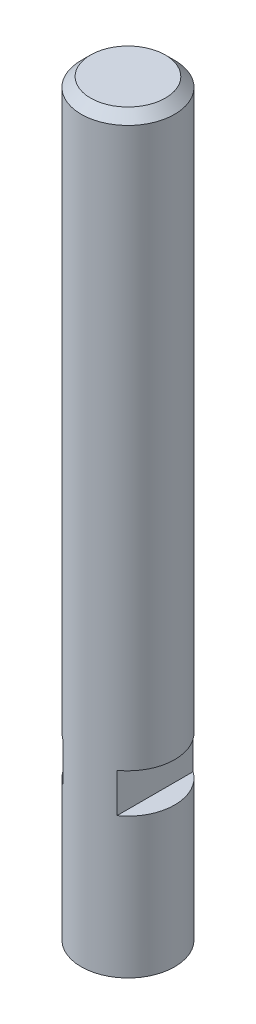
ISO-10303-21;
HEADER;
FILE_DESCRIPTION(('STEP AP214'),'2;1');
FILE_NAME('part.step','',(''),(''),'','','');
FILE_SCHEMA(('AUTOMOTIVE_DESIGN { 1 0 10303 214 1 1 1 1 }'));
ENDSEC;
DATA;
#1=APPLICATION_CONTEXT('core data for automotive mechanical design processes');
#2=APPLICATION_PROTOCOL_DEFINITION('international standard','automotive_design',2000,#1);
#3=PRODUCT_CONTEXT('',#1,'mechanical');
#4=PRODUCT('Part','Part','',(#3));
#5=PRODUCT_RELATED_PRODUCT_CATEGORY('part','',(#4));
#6=PRODUCT_DEFINITION_FORMATION('','',#4);
#7=PRODUCT_DEFINITION_CONTEXT('part definition',#1,'design');
#8=PRODUCT_DEFINITION('design','',#6,#7);
#9=PRODUCT_DEFINITION_SHAPE('','',#8);
#10=(LENGTH_UNIT() NAMED_UNIT(*) SI_UNIT(.MILLI.,.METRE.));
#11=(NAMED_UNIT(*) PLANE_ANGLE_UNIT() SI_UNIT($,.RADIAN.));
#12=(NAMED_UNIT(*) SI_UNIT($,.STERADIAN.) SOLID_ANGLE_UNIT());
#13=UNCERTAINTY_MEASURE_WITH_UNIT(LENGTH_MEASURE(1.E-05),#10,'distance_accuracy_value','');
#14=(GEOMETRIC_REPRESENTATION_CONTEXT(3) GLOBAL_UNCERTAINTY_ASSIGNED_CONTEXT((#13)) GLOBAL_UNIT_ASSIGNED_CONTEXT((#10,
#11,#12)) REPRESENTATION_CONTEXT('',''));
#15=CARTESIAN_POINT('',(0.,0.,0.));
#16=DIRECTION('',(0.,0.,1.));
#17=DIRECTION('',(1.,0.,0.));
#18=AXIS2_PLACEMENT_3D('',#15,#16,#17);
#19=CARTESIAN_POINT('',(0.,0.,0.));
#20=DIRECTION('',(0.,1.,0.));
#21=DIRECTION('',(0.,0.,1.));
#22=AXIS2_PLACEMENT_3D('',#19,#20,#21);
#23=CYLINDRICAL_SURFACE('',#22,5.);
#24=CARTESIAN_POINT('',(0.,79.,0.));
#25=DIRECTION('',(0.,1.,0.));
#26=DIRECTION('',(0.,0.,1.));
#27=AXIS2_PLACEMENT_3D('',#24,#25,#26);
#28=CIRCLE('',#27,5.);
#29=CARTESIAN_POINT('',(0.,79.,5.));
#30=VERTEX_POINT('',#29);
#31=EDGE_CURVE('E11',#30,#30,#28,.F.);
#32=ORIENTED_EDGE('',*,*,#31,.T.);
#33=EDGE_LOOP('',(#32));
#34=FACE_BOUND('',#33,.T.);
#35=CARTESIAN_POINT('',(0.,0.,0.));
#36=DIRECTION('',(0.,1.,0.));
#37=DIRECTION('',(0.,0.,1.));
#38=AXIS2_PLACEMENT_3D('',#35,#36,#37);
#39=CIRCLE('',#38,5.);
#40=CARTESIAN_POINT('',(0.,0.,5.));
#41=VERTEX_POINT('',#40);
#42=EDGE_CURVE('E160',#41,#41,#39,.T.);
#43=ORIENTED_EDGE('',*,*,#42,.T.);
#44=EDGE_LOOP('',(#43));
#45=FACE_BOUND('',#44,.T.);
#46=CARTESIAN_POINT('',(0.,15.,0.));
#47=DIRECTION('',(0.,-1.,0.));
#48=DIRECTION('',(0.,0.,-1.));
#49=AXIS2_PLACEMENT_3D('',#46,#47,#48);
#50=CIRCLE('',#49,5.);
#51=CARTESIAN_POINT('',(-2.9,15.,-4.07308237088327));
#52=VERTEX_POINT('',#51);
#53=CARTESIAN_POINT('',(-2.9,15.,4.07308237088327));
#54=VERTEX_POINT('',#53);
#55=EDGE_CURVE('E84',#52,#54,#50,.F.);
#56=ORIENTED_EDGE('',*,*,#55,.F.);
#57=DIRECTION('',(0.,1.,0.));
#58=VECTOR('',#57,1.);
#59=CARTESIAN_POINT('',(-2.9,0.,-4.07308237088327));
#60=LINE('',#59,#58);
#61=CARTESIAN_POINT('',(-2.9,19.2,-4.07308237088327));
#62=VERTEX_POINT('',#61);
#63=EDGE_CURVE('E167',#62,#52,#60,.F.);
#64=ORIENTED_EDGE('',*,*,#63,.F.);
#65=CARTESIAN_POINT('',(0.,19.2,0.));
#66=DIRECTION('',(0.,1.,0.));
#67=DIRECTION('',(0.,0.,1.));
#68=AXIS2_PLACEMENT_3D('',#65,#66,#67);
#69=CIRCLE('',#68,5.);
#70=CARTESIAN_POINT('',(-2.9,19.2,4.07308237088327));
#71=VERTEX_POINT('',#70);
#72=EDGE_CURVE('E163',#71,#62,#69,.F.);
#73=ORIENTED_EDGE('',*,*,#72,.F.);
#74=DIRECTION('',(0.,1.,0.));
#75=VECTOR('',#74,1.);
#76=CARTESIAN_POINT('',(-2.9,0.,4.07308237088327));
#77=LINE('',#76,#75);
#78=EDGE_CURVE('E165',#54,#71,#77,.T.);
#79=ORIENTED_EDGE('',*,*,#78,.F.);
#80=EDGE_LOOP('',(#56,#64,#73,#79));
#81=FACE_BOUND('',#80,.T.);
#82=DIRECTION('',(0.,1.,0.));
#83=VECTOR('',#82,1.);
#84=CARTESIAN_POINT('',(2.9,0.,4.07308237088327));
#85=LINE('',#84,#83);
#86=CARTESIAN_POINT('',(2.9,15.,4.07308237088327));
#87=VERTEX_POINT('',#86);
#88=CARTESIAN_POINT('',(2.9,19.2,4.07308237088327));
#89=VERTEX_POINT('',#88);
#90=EDGE_CURVE('E83',#87,#89,#85,.T.);
#91=ORIENTED_EDGE('',*,*,#90,.T.);
#92=CARTESIAN_POINT('',(0.,19.2,0.));
#93=DIRECTION('',(0.,-1.,0.));
#94=DIRECTION('',(0.,0.,-1.));
#95=AXIS2_PLACEMENT_3D('',#92,#93,#94);
#96=CIRCLE('',#95,5.);
#97=CARTESIAN_POINT('',(2.9,19.2,-4.07308237088327));
#98=VERTEX_POINT('',#97);
#99=EDGE_CURVE('E94',#89,#98,#96,.F.);
#100=ORIENTED_EDGE('',*,*,#99,.T.);
#101=DIRECTION('',(0.,1.,0.));
#102=VECTOR('',#101,1.);
#103=CARTESIAN_POINT('',(2.9,0.,-4.07308237088327));
#104=LINE('',#103,#102);
#105=CARTESIAN_POINT('',(2.9,15.,-4.07308237088327));
#106=VERTEX_POINT('',#105);
#107=EDGE_CURVE('E89',#98,#106,#104,.F.);
#108=ORIENTED_EDGE('',*,*,#107,.T.);
#109=CARTESIAN_POINT('',(0.,15.,0.));
#110=DIRECTION('',(0.,1.,0.));
#111=DIRECTION('',(0.,0.,1.));
#112=AXIS2_PLACEMENT_3D('',#109,#110,#111);
#113=CIRCLE('',#112,5.);
#114=EDGE_CURVE('E78',#106,#87,#113,.F.);
#115=ORIENTED_EDGE('',*,*,#114,.T.);
#116=EDGE_LOOP('',(#91,#100,#108,#115));
#117=FACE_BOUND('',#116,.T.);
#118=ADVANCED_FACE('F36',(#34,#45,#81,#117),#23,.T.);
#119=CARTESIAN_POINT('',(0.,80.,0.));
#120=DIRECTION('',(0.,1.,0.));
#121=DIRECTION('',(0.,0.,1.));
#122=AXIS2_PLACEMENT_3D('',#119,#120,#121);
#123=PLANE('',#122);
#124=CARTESIAN_POINT('',(0.,80.,0.));
#125=DIRECTION('',(0.,1.,0.));
#126=DIRECTION('',(0.,0.,1.));
#127=AXIS2_PLACEMENT_3D('',#124,#125,#126);
#128=CIRCLE('',#127,4.00000000000001);
#129=CARTESIAN_POINT('',(0.,80.,4.00000000000001));
#130=VERTEX_POINT('',#129);
#131=EDGE_CURVE('E44',#130,#130,#128,.T.);
#132=ORIENTED_EDGE('',*,*,#131,.T.);
#133=EDGE_LOOP('',(#132));
#134=FACE_BOUND('',#133,.T.);
#135=ADVANCED_FACE('F101',(#134),#123,.T.);
#136=CARTESIAN_POINT('',(0.,0.,5.));
#137=DIRECTION('',(0.,-1.,0.));
#138=DIRECTION('',(0.,0.,-1.));
#139=AXIS2_PLACEMENT_3D('',#136,#137,#138);
#140=PLANE('',#139);
#141=CARTESIAN_POINT('',(0.,0.,0.));
#142=DIRECTION('',(0.,-1.,0.));
#143=DIRECTION('',(0.,0.,-1.));
#144=AXIS2_PLACEMENT_3D('',#141,#142,#143);
#145=CIRCLE('',#144,1.64999999999999);
#146=CARTESIAN_POINT('',(0.,0.,-1.64999999999999));
#147=VERTEX_POINT('',#146);
#148=EDGE_CURVE('E153',#147,#147,#145,.T.);
#149=ORIENTED_EDGE('',*,*,#148,.F.);
#150=EDGE_LOOP('',(#149));
#151=FACE_BOUND('',#150,.T.);
#152=ORIENTED_EDGE('',*,*,#42,.F.);
#153=EDGE_LOOP('',(#152));
#154=FACE_BOUND('',#153,.T.);
#155=ADVANCED_FACE('F117',(#151,#154),#140,.T.);
#156=CARTESIAN_POINT('',(0.,40.,0.));
#157=DIRECTION('',(0.,-1.,0.));
#158=DIRECTION('',(0.,0.,-1.));
#159=AXIS2_PLACEMENT_3D('',#156,#157,#158);
#160=CONICAL_SURFACE('',#159,1.64999999999999,1.02974425867665);
#161=CARTESIAN_POINT('',(0.,40.9914200213955,0.));
#162=VERTEX_POINT('',#161);
#163=VERTEX_LOOP('',#162);
#164=FACE_BOUND('',#163,.T.);
#165=CARTESIAN_POINT('',(0.,40.,0.));
#166=DIRECTION('',(0.,-1.,0.));
#167=DIRECTION('',(0.,0.,-1.));
#168=AXIS2_PLACEMENT_3D('',#165,#166,#167);
#169=CIRCLE('',#168,1.64999999999999);
#170=CARTESIAN_POINT('',(0.,40.,-1.64999999999999));
#171=VERTEX_POINT('',#170);
#172=EDGE_CURVE('E157',#171,#171,#169,.T.);
#173=ORIENTED_EDGE('',*,*,#172,.T.);
#174=EDGE_LOOP('',(#173));
#175=FACE_BOUND('',#174,.T.);
#176=ADVANCED_FACE('F122',(#164,#175),#160,.F.);
#177=CARTESIAN_POINT('',(0.,0.,0.));
#178=DIRECTION('',(0.,-1.,0.));
#179=DIRECTION('',(0.,0.,-1.));
#180=AXIS2_PLACEMENT_3D('',#177,#178,#179);
#181=CYLINDRICAL_SURFACE('',#180,1.64999999999999);
#182=ORIENTED_EDGE('',*,*,#172,.F.);
#183=EDGE_LOOP('',(#182));
#184=FACE_BOUND('',#183,.T.);
#185=ORIENTED_EDGE('',*,*,#148,.T.);
#186=EDGE_LOOP('',(#185));
#187=FACE_BOUND('',#186,.T.);
#188=ADVANCED_FACE('F126',(#184,#187),#181,.F.);
#189=CARTESIAN_POINT('',(-2.9,19.2,-10.));
#190=DIRECTION('',(1.,0.,0.));
#191=DIRECTION('',(0.,0.,-1.));
#192=AXIS2_PLACEMENT_3D('',#189,#190,#191);
#193=PLANE('',#192);
#194=ORIENTED_EDGE('',*,*,#63,.T.);
#195=DIRECTION('',(0.,0.,1.));
#196=VECTOR('',#195,1.);
#197=CARTESIAN_POINT('',(-2.9,15.,-10.));
#198=LINE('',#197,#196);
#199=EDGE_CURVE('E149',#52,#54,#198,.T.);
#200=ORIENTED_EDGE('',*,*,#199,.T.);
#201=ORIENTED_EDGE('',*,*,#78,.T.);
#202=DIRECTION('',(0.,0.,1.));
#203=VECTOR('',#202,1.);
#204=CARTESIAN_POINT('',(-2.9,19.2,-10.));
#205=LINE('',#204,#203);
#206=EDGE_CURVE('E57',#62,#71,#205,.T.);
#207=ORIENTED_EDGE('',*,*,#206,.F.);
#208=EDGE_LOOP('',(#194,#200,#201,#207));
#209=FACE_BOUND('',#208,.T.);
#210=ADVANCED_FACE('F130',(#209),#193,.F.);
#211=CARTESIAN_POINT('',(-7.10000000000001,15.,-10.));
#212=DIRECTION('',(0.,-1.,0.));
#213=DIRECTION('',(0.,0.,-1.));
#214=AXIS2_PLACEMENT_3D('',#211,#212,#213);
#215=PLANE('',#214);
#216=ORIENTED_EDGE('',*,*,#55,.T.);
#217=ORIENTED_EDGE('',*,*,#199,.F.);
#218=EDGE_LOOP('',(#216,#217));
#219=FACE_BOUND('',#218,.T.);
#220=ADVANCED_FACE('F134',(#219),#215,.F.);
#221=CARTESIAN_POINT('',(-7.10000000000001,19.2,-10.));
#222=DIRECTION('',(0.,1.,0.));
#223=DIRECTION('',(0.,0.,1.));
#224=AXIS2_PLACEMENT_3D('',#221,#222,#223);
#225=PLANE('',#224);
#226=ORIENTED_EDGE('',*,*,#72,.T.);
#227=ORIENTED_EDGE('',*,*,#206,.T.);
#228=EDGE_LOOP('',(#226,#227));
#229=FACE_BOUND('',#228,.T.);
#230=ADVANCED_FACE('F136',(#229),#225,.F.);
#231=CARTESIAN_POINT('',(2.9,19.2,-10.));
#232=DIRECTION('',(1.,0.,0.));
#233=DIRECTION('',(0.,0.,-1.));
#234=AXIS2_PLACEMENT_3D('',#231,#232,#233);
#235=PLANE('',#234);
#236=DIRECTION('',(0.,0.,1.));
#237=VECTOR('',#236,1.);
#238=CARTESIAN_POINT('',(2.9,19.2,-10.));
#239=LINE('',#238,#237);
#240=EDGE_CURVE('E91',#98,#89,#239,.T.);
#241=ORIENTED_EDGE('',*,*,#240,.T.);
#242=ORIENTED_EDGE('',*,*,#90,.F.);
#243=DIRECTION('',(0.,0.,1.));
#244=VECTOR('',#243,1.);
#245=CARTESIAN_POINT('',(2.9,15.,-10.));
#246=LINE('',#245,#244);
#247=EDGE_CURVE('E50',#106,#87,#246,.T.);
#248=ORIENTED_EDGE('',*,*,#247,.F.);
#249=ORIENTED_EDGE('',*,*,#107,.F.);
#250=EDGE_LOOP('',(#241,#242,#248,#249));
#251=FACE_BOUND('',#250,.T.);
#252=ADVANCED_FACE('F88',(#251),#235,.T.);
#253=CARTESIAN_POINT('',(7.10000000000001,19.2,-10.));
#254=DIRECTION('',(0.,-1.,0.));
#255=DIRECTION('',(0.,0.,-1.));
#256=AXIS2_PLACEMENT_3D('',#253,#254,#255);
#257=PLANE('',#256);
#258=ORIENTED_EDGE('',*,*,#240,.F.);
#259=ORIENTED_EDGE('',*,*,#99,.F.);
#260=EDGE_LOOP('',(#258,#259));
#261=FACE_BOUND('',#260,.T.);
#262=ADVANCED_FACE('F108',(#261),#257,.T.);
#263=CARTESIAN_POINT('',(7.10000000000001,15.,-10.));
#264=DIRECTION('',(0.,1.,0.));
#265=DIRECTION('',(0.,0.,1.));
#266=AXIS2_PLACEMENT_3D('',#263,#264,#265);
#267=PLANE('',#266);
#268=ORIENTED_EDGE('',*,*,#247,.T.);
#269=ORIENTED_EDGE('',*,*,#114,.F.);
#270=EDGE_LOOP('',(#268,#269));
#271=FACE_BOUND('',#270,.T.);
#272=ADVANCED_FACE('F79',(#271),#267,.T.);
#273=CARTESIAN_POINT('',(0.,80.,0.));
#274=DIRECTION('',(0.,-1.,0.));
#275=DIRECTION('',(0.,0.,-1.));
#276=AXIS2_PLACEMENT_3D('',#273,#274,#275);
#277=CONICAL_SURFACE('',#276,4.00000000000001,0.785398163397445);
#278=ORIENTED_EDGE('',*,*,#31,.F.);
#279=EDGE_LOOP('',(#278));
#280=FACE_BOUND('',#279,.T.);
#281=ORIENTED_EDGE('',*,*,#131,.F.);
#282=EDGE_LOOP('',(#281));
#283=FACE_BOUND('',#282,.T.);
#284=ADVANCED_FACE('F38',(#280,#283),#277,.T.);
#285=CLOSED_SHELL('',(#118,#135,#155,#176,#188,#210,#220,#230,#252,#262,#272,#284));
#286=MANIFOLD_SOLID_BREP('B2',#285);
#287=ADVANCED_BREP_SHAPE_REPRESENTATION('',(#18,#286),#14);
#288=SHAPE_DEFINITION_REPRESENTATION(#9,#287);
ENDSEC;
END-ISO-10303-21;
